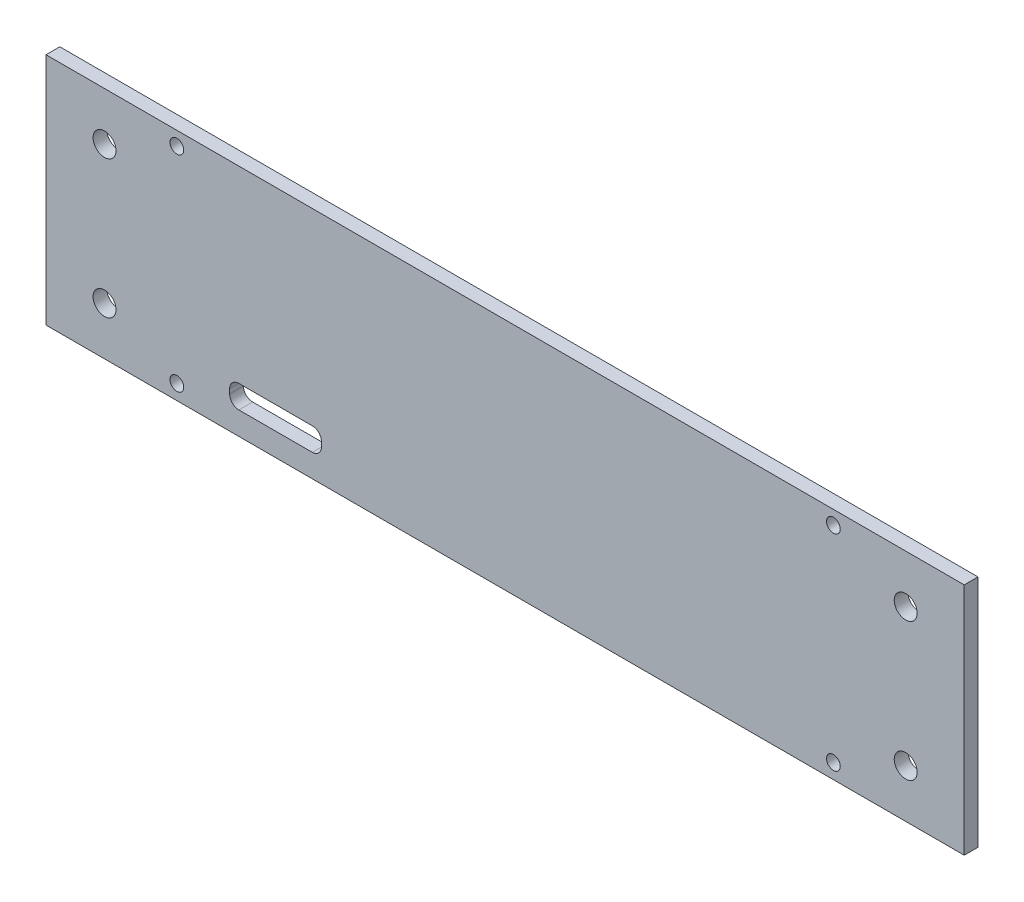
ISO-10303-21;
HEADER;
FILE_DESCRIPTION(('STEP AP214'),'2;1');
FILE_NAME('part.step','',(''),(''),'','','');
FILE_SCHEMA(('AUTOMOTIVE_DESIGN { 1 0 10303 214 1 1 1 1 }'));
ENDSEC;
DATA;
#1=APPLICATION_CONTEXT('core data for automotive mechanical design processes');
#2=APPLICATION_PROTOCOL_DEFINITION('international standard','automotive_design',2000,#1);
#3=PRODUCT_CONTEXT('',#1,'mechanical');
#4=PRODUCT('Part','Part','',(#3));
#5=PRODUCT_RELATED_PRODUCT_CATEGORY('part','',(#4));
#6=PRODUCT_DEFINITION_FORMATION('','',#4);
#7=PRODUCT_DEFINITION_CONTEXT('part definition',#1,'design');
#8=PRODUCT_DEFINITION('design','',#6,#7);
#9=PRODUCT_DEFINITION_SHAPE('','',#8);
#10=(LENGTH_UNIT() NAMED_UNIT(*) SI_UNIT(.MILLI.,.METRE.));
#11=(NAMED_UNIT(*) PLANE_ANGLE_UNIT() SI_UNIT($,.RADIAN.));
#12=(NAMED_UNIT(*) SI_UNIT($,.STERADIAN.) SOLID_ANGLE_UNIT());
#13=UNCERTAINTY_MEASURE_WITH_UNIT(LENGTH_MEASURE(1.E-05),#10,'distance_accuracy_value','');
#14=(GEOMETRIC_REPRESENTATION_CONTEXT(3) GLOBAL_UNCERTAINTY_ASSIGNED_CONTEXT((#13)) GLOBAL_UNIT_ASSIGNED_CONTEXT((#10,
#11,#12)) REPRESENTATION_CONTEXT('',''));
#15=CARTESIAN_POINT('',(0.,0.,0.));
#16=DIRECTION('',(0.,0.,1.));
#17=DIRECTION('',(1.,0.,0.));
#18=AXIS2_PLACEMENT_3D('',#15,#16,#17);
#19=CARTESIAN_POINT('',(0.,51.,3.));
#20=DIRECTION('',(0.,1.,0.));
#21=DIRECTION('',(0.,0.,1.));
#22=AXIS2_PLACEMENT_3D('',#19,#20,#21);
#23=PLANE('',#22);
#24=DIRECTION('',(1.,0.,0.));
#25=VECTOR('',#24,1.);
#26=CARTESIAN_POINT('',(0.,51.,0.));
#27=LINE('',#26,#25);
#28=CARTESIAN_POINT('',(0.,51.,0.));
#29=VERTEX_POINT('',#28);
#30=CARTESIAN_POINT('',(200.,51.,0.));
#31=VERTEX_POINT('',#30);
#32=EDGE_CURVE('E164',#29,#31,#27,.T.);
#33=ORIENTED_EDGE('',*,*,#32,.F.);
#34=DIRECTION('',(0.,0.,-1.));
#35=VECTOR('',#34,1.);
#36=CARTESIAN_POINT('',(0.,51.,3.));
#37=LINE('',#36,#35);
#38=CARTESIAN_POINT('',(0.,51.,3.));
#39=VERTEX_POINT('',#38);
#40=EDGE_CURVE('E152',#39,#29,#37,.T.);
#41=ORIENTED_EDGE('',*,*,#40,.F.);
#42=DIRECTION('',(1.,0.,0.));
#43=VECTOR('',#42,1.);
#44=CARTESIAN_POINT('',(0.,51.,3.));
#45=LINE('',#44,#43);
#46=CARTESIAN_POINT('',(200.,51.,3.));
#47=VERTEX_POINT('',#46);
#48=EDGE_CURVE('E133',#39,#47,#45,.T.);
#49=ORIENTED_EDGE('',*,*,#48,.T.);
#50=DIRECTION('',(0.,0.,-1.));
#51=VECTOR('',#50,1.);
#52=CARTESIAN_POINT('',(200.,51.,3.));
#53=LINE('',#52,#51);
#54=EDGE_CURVE('E142',#47,#31,#53,.T.);
#55=ORIENTED_EDGE('',*,*,#54,.T.);
#56=EDGE_LOOP('',(#33,#41,#49,#55));
#57=FACE_BOUND('',#56,.T.);
#58=ADVANCED_FACE('F39',(#57),#23,.T.);
#59=CARTESIAN_POINT('',(0.,0.,3.));
#60=DIRECTION('',(-1.,0.,0.));
#61=DIRECTION('',(0.,0.,1.));
#62=AXIS2_PLACEMENT_3D('',#59,#60,#61);
#63=PLANE('',#62);
#64=DIRECTION('',(0.,1.,0.));
#65=VECTOR('',#64,1.);
#66=CARTESIAN_POINT('',(0.,0.,0.));
#67=LINE('',#66,#65);
#68=CARTESIAN_POINT('',(0.,0.,0.));
#69=VERTEX_POINT('',#68);
#70=EDGE_CURVE('E153',#69,#29,#67,.T.);
#71=ORIENTED_EDGE('',*,*,#70,.F.);
#72=DIRECTION('',(0.,0.,-1.));
#73=VECTOR('',#72,1.);
#74=CARTESIAN_POINT('',(0.,0.,3.));
#75=LINE('',#74,#73);
#76=CARTESIAN_POINT('',(0.,0.,3.));
#77=VERTEX_POINT('',#76);
#78=EDGE_CURVE('E170',#77,#69,#75,.T.);
#79=ORIENTED_EDGE('',*,*,#78,.F.);
#80=DIRECTION('',(0.,1.,0.));
#81=VECTOR('',#80,1.);
#82=CARTESIAN_POINT('',(0.,0.,3.));
#83=LINE('',#82,#81);
#84=EDGE_CURVE('E150',#77,#39,#83,.T.);
#85=ORIENTED_EDGE('',*,*,#84,.T.);
#86=ORIENTED_EDGE('',*,*,#40,.T.);
#87=EDGE_LOOP('',(#71,#79,#85,#86));
#88=FACE_BOUND('',#87,.T.);
#89=ADVANCED_FACE('F295',(#88),#63,.T.);
#90=CARTESIAN_POINT('',(0.,0.,3.));
#91=DIRECTION('',(0.,1.,0.));
#92=DIRECTION('',(0.,0.,1.));
#93=AXIS2_PLACEMENT_3D('',#90,#91,#92);
#94=PLANE('',#93);
#95=DIRECTION('',(1.,0.,0.));
#96=VECTOR('',#95,1.);
#97=CARTESIAN_POINT('',(0.,0.,0.));
#98=LINE('',#97,#96);
#99=CARTESIAN_POINT('',(200.,0.,0.));
#100=VERTEX_POINT('',#99);
#101=EDGE_CURVE('E156',#69,#100,#98,.T.);
#102=ORIENTED_EDGE('',*,*,#101,.T.);
#103=DIRECTION('',(0.,0.,-1.));
#104=VECTOR('',#103,1.);
#105=CARTESIAN_POINT('',(200.,0.,3.));
#106=LINE('',#105,#104);
#107=CARTESIAN_POINT('',(200.,0.,3.));
#108=VERTEX_POINT('',#107);
#109=EDGE_CURVE('E149',#108,#100,#106,.T.);
#110=ORIENTED_EDGE('',*,*,#109,.F.);
#111=DIRECTION('',(1.,0.,0.));
#112=VECTOR('',#111,1.);
#113=CARTESIAN_POINT('',(0.,0.,3.));
#114=LINE('',#113,#112);
#115=EDGE_CURVE('E136',#77,#108,#114,.T.);
#116=ORIENTED_EDGE('',*,*,#115,.F.);
#117=ORIENTED_EDGE('',*,*,#78,.T.);
#118=EDGE_LOOP('',(#102,#110,#116,#117));
#119=FACE_BOUND('',#118,.T.);
#120=ADVANCED_FACE('F297',(#119),#94,.F.);
#121=CARTESIAN_POINT('',(200.,0.,3.));
#122=DIRECTION('',(-1.,0.,0.));
#123=DIRECTION('',(0.,0.,1.));
#124=AXIS2_PLACEMENT_3D('',#121,#122,#123);
#125=PLANE('',#124);
#126=DIRECTION('',(0.,1.,0.));
#127=VECTOR('',#126,1.);
#128=CARTESIAN_POINT('',(200.,0.,0.));
#129=LINE('',#128,#127);
#130=EDGE_CURVE('E145',#100,#31,#129,.T.);
#131=ORIENTED_EDGE('',*,*,#130,.T.);
#132=ORIENTED_EDGE('',*,*,#54,.F.);
#133=DIRECTION('',(0.,1.,0.));
#134=VECTOR('',#133,1.);
#135=CARTESIAN_POINT('',(200.,0.,3.));
#136=LINE('',#135,#134);
#137=EDGE_CURVE('E128',#108,#47,#136,.T.);
#138=ORIENTED_EDGE('',*,*,#137,.F.);
#139=ORIENTED_EDGE('',*,*,#109,.T.);
#140=EDGE_LOOP('',(#131,#132,#138,#139));
#141=FACE_BOUND('',#140,.T.);
#142=ADVANCED_FACE('F143',(#141),#125,.F.);
#143=CARTESIAN_POINT('',(0.,0.,3.));
#144=DIRECTION('',(0.,0.,1.));
#145=DIRECTION('',(1.,0.,0.));
#146=AXIS2_PLACEMENT_3D('',#143,#144,#145);
#147=PLANE('',#146);
#148=DIRECTION('',(0.,-1.,0.));
#149=VECTOR('',#148,1.);
#150=CARTESIAN_POINT('',(40.,10.,3.));
#151=LINE('',#150,#149);
#152=CARTESIAN_POINT('',(40.,8.,3.));
#153=VERTEX_POINT('',#152);
#154=CARTESIAN_POINT('',(40.,7.,3.));
#155=VERTEX_POINT('',#154);
#156=EDGE_CURVE('E205',#153,#155,#151,.T.);
#157=ORIENTED_EDGE('',*,*,#156,.F.);
#158=CARTESIAN_POINT('',(42.,8.,3.));
#159=DIRECTION('',(0.,0.,1.));
#160=DIRECTION('',(1.,0.,0.));
#161=AXIS2_PLACEMENT_3D('',#158,#159,#160);
#162=CIRCLE('',#161,2.);
#163=CARTESIAN_POINT('',(42.,10.,3.));
#164=VERTEX_POINT('',#163);
#165=EDGE_CURVE('E47',#153,#164,#162,.F.);
#166=ORIENTED_EDGE('',*,*,#165,.T.);
#167=DIRECTION('',(-1.,0.,0.));
#168=VECTOR('',#167,1.);
#169=CARTESIAN_POINT('',(40.,10.,3.));
#170=LINE('',#169,#168);
#171=CARTESIAN_POINT('',(58.,10.,3.));
#172=VERTEX_POINT('',#171);
#173=EDGE_CURVE('E204',#172,#164,#170,.T.);
#174=ORIENTED_EDGE('',*,*,#173,.F.);
#175=CARTESIAN_POINT('',(58.,8.,3.));
#176=DIRECTION('',(0.,0.,1.));
#177=DIRECTION('',(1.,0.,0.));
#178=AXIS2_PLACEMENT_3D('',#175,#176,#177);
#179=CIRCLE('',#178,2.);
#180=CARTESIAN_POINT('',(60.,8.,3.));
#181=VERTEX_POINT('',#180);
#182=EDGE_CURVE('E191',#172,#181,#179,.F.);
#183=ORIENTED_EDGE('',*,*,#182,.T.);
#184=DIRECTION('',(0.,1.,0.));
#185=VECTOR('',#184,1.);
#186=CARTESIAN_POINT('',(60.,10.,3.));
#187=LINE('',#186,#185);
#188=CARTESIAN_POINT('',(60.,7.,3.));
#189=VERTEX_POINT('',#188);
#190=EDGE_CURVE('E212',#189,#181,#187,.T.);
#191=ORIENTED_EDGE('',*,*,#190,.F.);
#192=CARTESIAN_POINT('',(58.,7.,3.));
#193=DIRECTION('',(0.,0.,1.));
#194=DIRECTION('',(1.,0.,0.));
#195=AXIS2_PLACEMENT_3D('',#192,#193,#194);
#196=CIRCLE('',#195,2.);
#197=CARTESIAN_POINT('',(58.,5.,3.));
#198=VERTEX_POINT('',#197);
#199=EDGE_CURVE('E195',#189,#198,#196,.F.);
#200=ORIENTED_EDGE('',*,*,#199,.T.);
#201=DIRECTION('',(1.,0.,0.));
#202=VECTOR('',#201,1.);
#203=CARTESIAN_POINT('',(40.,5.,3.));
#204=LINE('',#203,#202);
#205=CARTESIAN_POINT('',(42.,5.,3.));
#206=VERTEX_POINT('',#205);
#207=EDGE_CURVE('E235',#206,#198,#204,.T.);
#208=ORIENTED_EDGE('',*,*,#207,.F.);
#209=CARTESIAN_POINT('',(42.,7.,3.));
#210=DIRECTION('',(0.,0.,1.));
#211=DIRECTION('',(1.,0.,0.));
#212=AXIS2_PLACEMENT_3D('',#209,#210,#211);
#213=CIRCLE('',#212,2.);
#214=EDGE_CURVE('E54',#206,#155,#213,.F.);
#215=ORIENTED_EDGE('',*,*,#214,.T.);
#216=EDGE_LOOP('',(#157,#166,#174,#183,#191,#200,#208,#215));
#217=FACE_BOUND('',#216,.T.);
#218=CARTESIAN_POINT('',(187.25,40.5,3.));
#219=DIRECTION('',(0.,0.,1.));
#220=DIRECTION('',(-1.,0.,0.));
#221=AXIS2_PLACEMENT_3D('',#218,#219,#220);
#222=CIRCLE('',#221,2.50000000000002);
#223=CARTESIAN_POINT('',(184.75,40.5,3.));
#224=VERTEX_POINT('',#223);
#225=EDGE_CURVE('E247',#224,#224,#222,.T.);
#226=ORIENTED_EDGE('',*,*,#225,.F.);
#227=EDGE_LOOP('',(#226));
#228=FACE_BOUND('',#227,.T.);
#229=CARTESIAN_POINT('',(12.75,10.5,3.));
#230=DIRECTION('',(0.,0.,1.));
#231=DIRECTION('',(1.,0.,0.));
#232=AXIS2_PLACEMENT_3D('',#229,#230,#231);
#233=CIRCLE('',#232,2.5);
#234=CARTESIAN_POINT('',(15.25,10.5,3.));
#235=VERTEX_POINT('',#234);
#236=EDGE_CURVE('E258',#235,#235,#233,.T.);
#237=ORIENTED_EDGE('',*,*,#236,.F.);
#238=EDGE_LOOP('',(#237));
#239=FACE_BOUND('',#238,.T.);
#240=CARTESIAN_POINT('',(12.75,40.5,3.));
#241=DIRECTION('',(0.,0.,1.));
#242=DIRECTION('',(1.,0.,0.));
#243=AXIS2_PLACEMENT_3D('',#240,#241,#242);
#244=CIRCLE('',#243,2.5);
#245=CARTESIAN_POINT('',(15.25,40.5,3.));
#246=VERTEX_POINT('',#245);
#247=EDGE_CURVE('E265',#246,#246,#244,.T.);
#248=ORIENTED_EDGE('',*,*,#247,.F.);
#249=EDGE_LOOP('',(#248));
#250=FACE_BOUND('',#249,.T.);
#251=CARTESIAN_POINT('',(28.5,3.25,3.));
#252=DIRECTION('',(0.,0.,1.));
#253=DIRECTION('',(1.,0.,0.));
#254=AXIS2_PLACEMENT_3D('',#251,#252,#253);
#255=CIRCLE('',#254,1.5);
#256=CARTESIAN_POINT('',(30.,3.25,3.));
#257=VERTEX_POINT('',#256);
#258=EDGE_CURVE('E270',#257,#257,#255,.T.);
#259=ORIENTED_EDGE('',*,*,#258,.F.);
#260=EDGE_LOOP('',(#259));
#261=FACE_BOUND('',#260,.T.);
#262=CARTESIAN_POINT('',(187.25,10.5,3.));
#263=DIRECTION('',(0.,0.,1.));
#264=DIRECTION('',(-1.,0.,0.));
#265=AXIS2_PLACEMENT_3D('',#262,#263,#264);
#266=CIRCLE('',#265,2.5);
#267=CARTESIAN_POINT('',(184.75,10.5,3.));
#268=VERTEX_POINT('',#267);
#269=EDGE_CURVE('E240',#268,#268,#266,.T.);
#270=ORIENTED_EDGE('',*,*,#269,.F.);
#271=EDGE_LOOP('',(#270));
#272=FACE_BOUND('',#271,.T.);
#273=CARTESIAN_POINT('',(171.5,3.25000000000001,3.));
#274=DIRECTION('',(0.,0.,1.));
#275=DIRECTION('',(-1.,0.,0.));
#276=AXIS2_PLACEMENT_3D('',#273,#274,#275);
#277=CIRCLE('',#276,1.5);
#278=CARTESIAN_POINT('',(170.,3.25000000000001,3.));
#279=VERTEX_POINT('',#278);
#280=EDGE_CURVE('E248',#279,#279,#277,.T.);
#281=ORIENTED_EDGE('',*,*,#280,.F.);
#282=EDGE_LOOP('',(#281));
#283=FACE_BOUND('',#282,.T.);
#284=CARTESIAN_POINT('',(171.5,48.,3.));
#285=DIRECTION('',(0.,0.,1.));
#286=DIRECTION('',(-1.,0.,0.));
#287=AXIS2_PLACEMENT_3D('',#284,#285,#286);
#288=CIRCLE('',#287,1.49999999999997);
#289=CARTESIAN_POINT('',(170.,48.,3.));
#290=VERTEX_POINT('',#289);
#291=EDGE_CURVE('E229',#290,#290,#288,.T.);
#292=ORIENTED_EDGE('',*,*,#291,.F.);
#293=EDGE_LOOP('',(#292));
#294=FACE_BOUND('',#293,.T.);
#295=CARTESIAN_POINT('',(28.5,48.,3.));
#296=DIRECTION('',(0.,0.,1.));
#297=DIRECTION('',(1.,0.,0.));
#298=AXIS2_PLACEMENT_3D('',#295,#296,#297);
#299=CIRCLE('',#298,1.5);
#300=CARTESIAN_POINT('',(30.,48.,3.));
#301=VERTEX_POINT('',#300);
#302=EDGE_CURVE('E277',#301,#301,#299,.T.);
#303=ORIENTED_EDGE('',*,*,#302,.F.);
#304=EDGE_LOOP('',(#303));
#305=FACE_BOUND('',#304,.T.);
#306=ORIENTED_EDGE('',*,*,#48,.F.);
#307=ORIENTED_EDGE('',*,*,#84,.F.);
#308=ORIENTED_EDGE('',*,*,#115,.T.);
#309=ORIENTED_EDGE('',*,*,#137,.T.);
#310=EDGE_LOOP('',(#306,#307,#308,#309));
#311=FACE_BOUND('',#310,.T.);
#312=ADVANCED_FACE('F130',(#217,#228,#239,#250,#261,#272,#283,#294,#305,#311),#147,.T.);
#313=CARTESIAN_POINT('',(0.,0.,0.));
#314=DIRECTION('',(0.,0.,1.));
#315=DIRECTION('',(1.,0.,0.));
#316=AXIS2_PLACEMENT_3D('',#313,#314,#315);
#317=PLANE('',#316);
#318=DIRECTION('',(1.,0.,0.));
#319=VECTOR('',#318,1.);
#320=CARTESIAN_POINT('',(40.,10.,0.));
#321=LINE('',#320,#319);
#322=CARTESIAN_POINT('',(42.,10.,0.));
#323=VERTEX_POINT('',#322);
#324=CARTESIAN_POINT('',(58.,10.,0.));
#325=VERTEX_POINT('',#324);
#326=EDGE_CURVE('E222',#323,#325,#321,.T.);
#327=ORIENTED_EDGE('',*,*,#326,.F.);
#328=CARTESIAN_POINT('',(42.,8.,0.));
#329=DIRECTION('',(0.,0.,1.));
#330=DIRECTION('',(1.,0.,0.));
#331=AXIS2_PLACEMENT_3D('',#328,#329,#330);
#332=CIRCLE('',#331,2.);
#333=CARTESIAN_POINT('',(40.,8.,0.));
#334=VERTEX_POINT('',#333);
#335=EDGE_CURVE('E11',#323,#334,#332,.T.);
#336=ORIENTED_EDGE('',*,*,#335,.T.);
#337=DIRECTION('',(0.,1.,0.));
#338=VECTOR('',#337,1.);
#339=CARTESIAN_POINT('',(40.,10.,0.));
#340=LINE('',#339,#338);
#341=CARTESIAN_POINT('',(40.,7.,0.));
#342=VERTEX_POINT('',#341);
#343=EDGE_CURVE('E220',#342,#334,#340,.T.);
#344=ORIENTED_EDGE('',*,*,#343,.F.);
#345=CARTESIAN_POINT('',(42.,7.,0.));
#346=DIRECTION('',(0.,0.,1.));
#347=DIRECTION('',(1.,0.,0.));
#348=AXIS2_PLACEMENT_3D('',#345,#346,#347);
#349=CIRCLE('',#348,2.);
#350=CARTESIAN_POINT('',(42.,5.,0.));
#351=VERTEX_POINT('',#350);
#352=EDGE_CURVE('E200',#342,#351,#349,.T.);
#353=ORIENTED_EDGE('',*,*,#352,.T.);
#354=DIRECTION('',(-1.,0.,0.));
#355=VECTOR('',#354,1.);
#356=CARTESIAN_POINT('',(40.,5.,0.));
#357=LINE('',#356,#355);
#358=CARTESIAN_POINT('',(58.,5.,0.));
#359=VERTEX_POINT('',#358);
#360=EDGE_CURVE('E226',#359,#351,#357,.T.);
#361=ORIENTED_EDGE('',*,*,#360,.F.);
#362=CARTESIAN_POINT('',(58.,7.,0.));
#363=DIRECTION('',(0.,0.,1.));
#364=DIRECTION('',(1.,0.,0.));
#365=AXIS2_PLACEMENT_3D('',#362,#363,#364);
#366=CIRCLE('',#365,2.);
#367=CARTESIAN_POINT('',(60.,7.,0.));
#368=VERTEX_POINT('',#367);
#369=EDGE_CURVE('E197',#359,#368,#366,.T.);
#370=ORIENTED_EDGE('',*,*,#369,.T.);
#371=DIRECTION('',(0.,-1.,0.));
#372=VECTOR('',#371,1.);
#373=CARTESIAN_POINT('',(60.,10.,0.));
#374=LINE('',#373,#372);
#375=CARTESIAN_POINT('',(60.,8.,0.));
#376=VERTEX_POINT('',#375);
#377=EDGE_CURVE('E211',#376,#368,#374,.T.);
#378=ORIENTED_EDGE('',*,*,#377,.F.);
#379=CARTESIAN_POINT('',(58.,8.,0.));
#380=DIRECTION('',(0.,0.,1.));
#381=DIRECTION('',(1.,0.,0.));
#382=AXIS2_PLACEMENT_3D('',#379,#380,#381);
#383=CIRCLE('',#382,2.);
#384=EDGE_CURVE('E193',#376,#325,#383,.T.);
#385=ORIENTED_EDGE('',*,*,#384,.T.);
#386=EDGE_LOOP('',(#327,#336,#344,#353,#361,#370,#378,#385));
#387=FACE_BOUND('',#386,.T.);
#388=CARTESIAN_POINT('',(187.25,40.5,0.));
#389=DIRECTION('',(0.,0.,1.));
#390=DIRECTION('',(1.,0.,0.));
#391=AXIS2_PLACEMENT_3D('',#388,#389,#390);
#392=CIRCLE('',#391,2.50000000000002);
#393=CARTESIAN_POINT('',(189.75,40.5,0.));
#394=VERTEX_POINT('',#393);
#395=EDGE_CURVE('E262',#394,#394,#392,.F.);
#396=ORIENTED_EDGE('',*,*,#395,.F.);
#397=EDGE_LOOP('',(#396));
#398=FACE_BOUND('',#397,.T.);
#399=CARTESIAN_POINT('',(12.75,10.5,0.));
#400=DIRECTION('',(0.,0.,1.));
#401=DIRECTION('',(1.,0.,0.));
#402=AXIS2_PLACEMENT_3D('',#399,#400,#401);
#403=CIRCLE('',#402,2.5);
#404=CARTESIAN_POINT('',(15.25,10.5,0.));
#405=VERTEX_POINT('',#404);
#406=EDGE_CURVE('E261',#405,#405,#403,.F.);
#407=ORIENTED_EDGE('',*,*,#406,.F.);
#408=EDGE_LOOP('',(#407));
#409=FACE_BOUND('',#408,.T.);
#410=CARTESIAN_POINT('',(12.75,40.5,0.));
#411=DIRECTION('',(0.,0.,1.));
#412=DIRECTION('',(1.,0.,0.));
#413=AXIS2_PLACEMENT_3D('',#410,#411,#412);
#414=CIRCLE('',#413,2.5);
#415=CARTESIAN_POINT('',(15.25,40.5,0.));
#416=VERTEX_POINT('',#415);
#417=EDGE_CURVE('E274',#416,#416,#414,.F.);
#418=ORIENTED_EDGE('',*,*,#417,.F.);
#419=EDGE_LOOP('',(#418));
#420=FACE_BOUND('',#419,.T.);
#421=CARTESIAN_POINT('',(28.5,3.25,0.));
#422=DIRECTION('',(0.,0.,1.));
#423=DIRECTION('',(1.,0.,0.));
#424=AXIS2_PLACEMENT_3D('',#421,#422,#423);
#425=CIRCLE('',#424,1.5);
#426=CARTESIAN_POINT('',(30.,3.25,0.));
#427=VERTEX_POINT('',#426);
#428=EDGE_CURVE('E273',#427,#427,#425,.F.);
#429=ORIENTED_EDGE('',*,*,#428,.F.);
#430=EDGE_LOOP('',(#429));
#431=FACE_BOUND('',#430,.T.);
#432=CARTESIAN_POINT('',(187.25,10.5,0.));
#433=DIRECTION('',(0.,0.,1.));
#434=DIRECTION('',(1.,0.,0.));
#435=AXIS2_PLACEMENT_3D('',#432,#433,#434);
#436=CIRCLE('',#435,2.5);
#437=CARTESIAN_POINT('',(189.75,10.5,0.));
#438=VERTEX_POINT('',#437);
#439=EDGE_CURVE('E243',#438,#438,#436,.F.);
#440=ORIENTED_EDGE('',*,*,#439,.F.);
#441=EDGE_LOOP('',(#440));
#442=FACE_BOUND('',#441,.T.);
#443=CARTESIAN_POINT('',(171.5,3.25000000000001,0.));
#444=DIRECTION('',(0.,0.,1.));
#445=DIRECTION('',(1.,0.,0.));
#446=AXIS2_PLACEMENT_3D('',#443,#444,#445);
#447=CIRCLE('',#446,1.5);
#448=CARTESIAN_POINT('',(173.,3.25000000000001,0.));
#449=VERTEX_POINT('',#448);
#450=EDGE_CURVE('E244',#449,#449,#447,.F.);
#451=ORIENTED_EDGE('',*,*,#450,.F.);
#452=EDGE_LOOP('',(#451));
#453=FACE_BOUND('',#452,.T.);
#454=CARTESIAN_POINT('',(171.5,48.,0.));
#455=DIRECTION('',(0.,0.,1.));
#456=DIRECTION('',(1.,0.,0.));
#457=AXIS2_PLACEMENT_3D('',#454,#455,#456);
#458=CIRCLE('',#457,1.49999999999997);
#459=CARTESIAN_POINT('',(173.,48.,0.));
#460=VERTEX_POINT('',#459);
#461=EDGE_CURVE('E251',#460,#460,#458,.F.);
#462=ORIENTED_EDGE('',*,*,#461,.F.);
#463=EDGE_LOOP('',(#462));
#464=FACE_BOUND('',#463,.T.);
#465=CARTESIAN_POINT('',(28.5,48.,0.));
#466=DIRECTION('',(0.,0.,1.));
#467=DIRECTION('',(1.,0.,0.));
#468=AXIS2_PLACEMENT_3D('',#465,#466,#467);
#469=CIRCLE('',#468,1.5);
#470=CARTESIAN_POINT('',(30.,48.,0.));
#471=VERTEX_POINT('',#470);
#472=EDGE_CURVE('E159',#471,#471,#469,.F.);
#473=ORIENTED_EDGE('',*,*,#472,.F.);
#474=EDGE_LOOP('',(#473));
#475=FACE_BOUND('',#474,.T.);
#476=ORIENTED_EDGE('',*,*,#32,.T.);
#477=ORIENTED_EDGE('',*,*,#130,.F.);
#478=ORIENTED_EDGE('',*,*,#101,.F.);
#479=ORIENTED_EDGE('',*,*,#70,.T.);
#480=EDGE_LOOP('',(#476,#477,#478,#479));
#481=FACE_BOUND('',#480,.T.);
#482=ADVANCED_FACE('F218',(#387,#398,#409,#420,#431,#442,#453,#464,#475,#481),#317,.F.);
#483=CARTESIAN_POINT('',(28.5,48.,-7.07106781186555));
#484=DIRECTION('',(0.,0.,1.));
#485=DIRECTION('',(1.,0.,0.));
#486=AXIS2_PLACEMENT_3D('',#483,#484,#485);
#487=CYLINDRICAL_SURFACE('',#486,1.5);
#488=ORIENTED_EDGE('',*,*,#472,.T.);
#489=EDGE_LOOP('',(#488));
#490=FACE_BOUND('',#489,.T.);
#491=ORIENTED_EDGE('',*,*,#302,.T.);
#492=EDGE_LOOP('',(#491));
#493=FACE_BOUND('',#492,.T.);
#494=ADVANCED_FACE('F287',(#490,#493),#487,.F.);
#495=CARTESIAN_POINT('',(171.5,48.,-7.07106781186555));
#496=DIRECTION('',(0.,0.,1.));
#497=DIRECTION('',(1.,0.,0.));
#498=AXIS2_PLACEMENT_3D('',#495,#496,#497);
#499=CYLINDRICAL_SURFACE('',#498,1.49999999999997);
#500=ORIENTED_EDGE('',*,*,#461,.T.);
#501=EDGE_LOOP('',(#500));
#502=FACE_BOUND('',#501,.T.);
#503=ORIENTED_EDGE('',*,*,#291,.T.);
#504=EDGE_LOOP('',(#503));
#505=FACE_BOUND('',#504,.T.);
#506=ADVANCED_FACE('F358',(#502,#505),#499,.F.);
#507=CARTESIAN_POINT('',(171.5,3.25000000000001,-7.07106781186555));
#508=DIRECTION('',(0.,0.,1.));
#509=DIRECTION('',(1.,0.,0.));
#510=AXIS2_PLACEMENT_3D('',#507,#508,#509);
#511=CYLINDRICAL_SURFACE('',#510,1.5);
#512=ORIENTED_EDGE('',*,*,#450,.T.);
#513=EDGE_LOOP('',(#512));
#514=FACE_BOUND('',#513,.T.);
#515=ORIENTED_EDGE('',*,*,#280,.T.);
#516=EDGE_LOOP('',(#515));
#517=FACE_BOUND('',#516,.T.);
#518=ADVANCED_FACE('F354',(#514,#517),#511,.F.);
#519=CARTESIAN_POINT('',(187.25,10.5,-7.07106781186555));
#520=DIRECTION('',(0.,0.,1.));
#521=DIRECTION('',(1.,0.,0.));
#522=AXIS2_PLACEMENT_3D('',#519,#520,#521);
#523=CYLINDRICAL_SURFACE('',#522,2.5);
#524=ORIENTED_EDGE('',*,*,#439,.T.);
#525=EDGE_LOOP('',(#524));
#526=FACE_BOUND('',#525,.T.);
#527=ORIENTED_EDGE('',*,*,#269,.T.);
#528=EDGE_LOOP('',(#527));
#529=FACE_BOUND('',#528,.T.);
#530=ADVANCED_FACE('F350',(#526,#529),#523,.F.);
#531=CARTESIAN_POINT('',(28.5,3.25,-7.07106781186555));
#532=DIRECTION('',(0.,0.,1.));
#533=DIRECTION('',(1.,0.,0.));
#534=AXIS2_PLACEMENT_3D('',#531,#532,#533);
#535=CYLINDRICAL_SURFACE('',#534,1.5);
#536=ORIENTED_EDGE('',*,*,#428,.T.);
#537=EDGE_LOOP('',(#536));
#538=FACE_BOUND('',#537,.T.);
#539=ORIENTED_EDGE('',*,*,#258,.T.);
#540=EDGE_LOOP('',(#539));
#541=FACE_BOUND('',#540,.T.);
#542=ADVANCED_FACE('F353',(#538,#541),#535,.F.);
#543=CARTESIAN_POINT('',(12.75,40.5,-7.07106781186555));
#544=DIRECTION('',(0.,0.,1.));
#545=DIRECTION('',(1.,0.,0.));
#546=AXIS2_PLACEMENT_3D('',#543,#544,#545);
#547=CYLINDRICAL_SURFACE('',#546,2.5);
#548=ORIENTED_EDGE('',*,*,#417,.T.);
#549=EDGE_LOOP('',(#548));
#550=FACE_BOUND('',#549,.T.);
#551=ORIENTED_EDGE('',*,*,#247,.T.);
#552=EDGE_LOOP('',(#551));
#553=FACE_BOUND('',#552,.T.);
#554=ADVANCED_FACE('F366',(#550,#553),#547,.F.);
#555=CARTESIAN_POINT('',(12.75,10.5,-7.07106781186555));
#556=DIRECTION('',(0.,0.,1.));
#557=DIRECTION('',(1.,0.,0.));
#558=AXIS2_PLACEMENT_3D('',#555,#556,#557);
#559=CYLINDRICAL_SURFACE('',#558,2.5);
#560=ORIENTED_EDGE('',*,*,#406,.T.);
#561=EDGE_LOOP('',(#560));
#562=FACE_BOUND('',#561,.T.);
#563=ORIENTED_EDGE('',*,*,#236,.T.);
#564=EDGE_LOOP('',(#563));
#565=FACE_BOUND('',#564,.T.);
#566=ADVANCED_FACE('F363',(#562,#565),#559,.F.);
#567=CARTESIAN_POINT('',(187.25,40.5,-7.07106781186555));
#568=DIRECTION('',(0.,0.,1.));
#569=DIRECTION('',(1.,0.,0.));
#570=AXIS2_PLACEMENT_3D('',#567,#568,#569);
#571=CYLINDRICAL_SURFACE('',#570,2.50000000000002);
#572=ORIENTED_EDGE('',*,*,#395,.T.);
#573=EDGE_LOOP('',(#572));
#574=FACE_BOUND('',#573,.T.);
#575=ORIENTED_EDGE('',*,*,#225,.T.);
#576=EDGE_LOOP('',(#575));
#577=FACE_BOUND('',#576,.T.);
#578=ADVANCED_FACE('F349',(#574,#577),#571,.F.);
#579=CARTESIAN_POINT('',(40.,10.,-20.6155281280883));
#580=DIRECTION('',(-1.,0.,0.));
#581=DIRECTION('',(0.,0.,1.));
#582=AXIS2_PLACEMENT_3D('',#579,#580,#581);
#583=PLANE('',#582);
#584=ORIENTED_EDGE('',*,*,#156,.T.);
#585=DIRECTION('',(0.,0.,1.));
#586=VECTOR('',#585,1.);
#587=CARTESIAN_POINT('',(40.,7.,0.));
#588=LINE('',#587,#586);
#589=EDGE_CURVE('E189',#155,#342,#588,.F.);
#590=ORIENTED_EDGE('',*,*,#589,.T.);
#591=ORIENTED_EDGE('',*,*,#343,.T.);
#592=DIRECTION('',(0.,0.,1.));
#593=VECTOR('',#592,1.);
#594=CARTESIAN_POINT('',(40.,8.,3.));
#595=LINE('',#594,#593);
#596=EDGE_CURVE('E187',#334,#153,#595,.T.);
#597=ORIENTED_EDGE('',*,*,#596,.T.);
#598=EDGE_LOOP('',(#584,#590,#591,#597));
#599=FACE_BOUND('',#598,.T.);
#600=ADVANCED_FACE('F224',(#599),#583,.F.);
#601=CARTESIAN_POINT('',(40.,10.,-20.6155281280883));
#602=DIRECTION('',(0.,1.,0.));
#603=DIRECTION('',(0.,0.,1.));
#604=AXIS2_PLACEMENT_3D('',#601,#602,#603);
#605=PLANE('',#604);
#606=ORIENTED_EDGE('',*,*,#326,.T.);
#607=DIRECTION('',(0.,0.,1.));
#608=VECTOR('',#607,1.);
#609=CARTESIAN_POINT('',(58.,10.,3.));
#610=LINE('',#609,#608);
#611=EDGE_CURVE('E174',#325,#172,#610,.T.);
#612=ORIENTED_EDGE('',*,*,#611,.T.);
#613=ORIENTED_EDGE('',*,*,#173,.T.);
#614=DIRECTION('',(0.,0.,1.));
#615=VECTOR('',#614,1.);
#616=CARTESIAN_POINT('',(42.,10.,0.));
#617=LINE('',#616,#615);
#618=EDGE_CURVE('E169',#164,#323,#617,.F.);
#619=ORIENTED_EDGE('',*,*,#618,.T.);
#620=EDGE_LOOP('',(#606,#612,#613,#619));
#621=FACE_BOUND('',#620,.T.);
#622=ADVANCED_FACE('F208',(#621),#605,.F.);
#623=CARTESIAN_POINT('',(60.,10.,-20.6155281280883));
#624=DIRECTION('',(1.,0.,0.));
#625=DIRECTION('',(0.,0.,-1.));
#626=AXIS2_PLACEMENT_3D('',#623,#624,#625);
#627=PLANE('',#626);
#628=ORIENTED_EDGE('',*,*,#190,.T.);
#629=DIRECTION('',(0.,0.,1.));
#630=VECTOR('',#629,1.);
#631=CARTESIAN_POINT('',(60.,8.,0.));
#632=LINE('',#631,#630);
#633=EDGE_CURVE('E180',#181,#376,#632,.F.);
#634=ORIENTED_EDGE('',*,*,#633,.T.);
#635=ORIENTED_EDGE('',*,*,#377,.T.);
#636=DIRECTION('',(0.,0.,1.));
#637=VECTOR('',#636,1.);
#638=CARTESIAN_POINT('',(60.,7.,3.));
#639=LINE('',#638,#637);
#640=EDGE_CURVE('E177',#368,#189,#639,.T.);
#641=ORIENTED_EDGE('',*,*,#640,.T.);
#642=EDGE_LOOP('',(#628,#634,#635,#641));
#643=FACE_BOUND('',#642,.T.);
#644=ADVANCED_FACE('F335',(#643),#627,.F.);
#645=CARTESIAN_POINT('',(40.,5.,-20.6155281280883));
#646=DIRECTION('',(0.,-1.,0.));
#647=DIRECTION('',(0.,0.,-1.));
#648=AXIS2_PLACEMENT_3D('',#645,#646,#647);
#649=PLANE('',#648);
#650=ORIENTED_EDGE('',*,*,#207,.T.);
#651=DIRECTION('',(0.,0.,1.));
#652=VECTOR('',#651,1.);
#653=CARTESIAN_POINT('',(58.,5.,0.));
#654=LINE('',#653,#652);
#655=EDGE_CURVE('E185',#198,#359,#654,.F.);
#656=ORIENTED_EDGE('',*,*,#655,.T.);
#657=ORIENTED_EDGE('',*,*,#360,.T.);
#658=DIRECTION('',(0.,0.,1.));
#659=VECTOR('',#658,1.);
#660=CARTESIAN_POINT('',(42.,5.,3.));
#661=LINE('',#660,#659);
#662=EDGE_CURVE('E182',#351,#206,#661,.T.);
#663=ORIENTED_EDGE('',*,*,#662,.T.);
#664=EDGE_LOOP('',(#650,#656,#657,#663));
#665=FACE_BOUND('',#664,.T.);
#666=ADVANCED_FACE('F315',(#665),#649,.F.);
#667=CARTESIAN_POINT('',(58.,8.,-20.6155281280883));
#668=DIRECTION('',(0.,0.,-1.));
#669=DIRECTION('',(-1.,0.,0.));
#670=AXIS2_PLACEMENT_3D('',#667,#668,#669);
#671=CYLINDRICAL_SURFACE('',#670,2.);
#672=ORIENTED_EDGE('',*,*,#384,.F.);
#673=ORIENTED_EDGE('',*,*,#633,.F.);
#674=ORIENTED_EDGE('',*,*,#182,.F.);
#675=ORIENTED_EDGE('',*,*,#611,.F.);
#676=EDGE_LOOP('',(#672,#673,#674,#675));
#677=FACE_BOUND('',#676,.T.);
#678=ADVANCED_FACE('F311',(#677),#671,.F.);
#679=CARTESIAN_POINT('',(58.,7.,-20.6155281280883));
#680=DIRECTION('',(0.,0.,-1.));
#681=DIRECTION('',(-1.,0.,0.));
#682=AXIS2_PLACEMENT_3D('',#679,#680,#681);
#683=CYLINDRICAL_SURFACE('',#682,2.);
#684=ORIENTED_EDGE('',*,*,#369,.F.);
#685=ORIENTED_EDGE('',*,*,#655,.F.);
#686=ORIENTED_EDGE('',*,*,#199,.F.);
#687=ORIENTED_EDGE('',*,*,#640,.F.);
#688=EDGE_LOOP('',(#684,#685,#686,#687));
#689=FACE_BOUND('',#688,.T.);
#690=ADVANCED_FACE('F314',(#689),#683,.F.);
#691=CARTESIAN_POINT('',(42.,7.,-20.6155281280883));
#692=DIRECTION('',(0.,0.,-1.));
#693=DIRECTION('',(-1.,0.,0.));
#694=AXIS2_PLACEMENT_3D('',#691,#692,#693);
#695=CYLINDRICAL_SURFACE('',#694,2.);
#696=ORIENTED_EDGE('',*,*,#352,.F.);
#697=ORIENTED_EDGE('',*,*,#589,.F.);
#698=ORIENTED_EDGE('',*,*,#214,.F.);
#699=ORIENTED_EDGE('',*,*,#662,.F.);
#700=EDGE_LOOP('',(#696,#697,#698,#699));
#701=FACE_BOUND('',#700,.T.);
#702=ADVANCED_FACE('F318',(#701),#695,.F.);
#703=CARTESIAN_POINT('',(42.,8.,-20.6155281280883));
#704=DIRECTION('',(0.,0.,-1.));
#705=DIRECTION('',(-1.,0.,0.));
#706=AXIS2_PLACEMENT_3D('',#703,#704,#705);
#707=CYLINDRICAL_SURFACE('',#706,2.);
#708=ORIENTED_EDGE('',*,*,#335,.F.);
#709=ORIENTED_EDGE('',*,*,#618,.F.);
#710=ORIENTED_EDGE('',*,*,#165,.F.);
#711=ORIENTED_EDGE('',*,*,#596,.F.);
#712=EDGE_LOOP('',(#708,#709,#710,#711));
#713=FACE_BOUND('',#712,.T.);
#714=ADVANCED_FACE('F41',(#713),#707,.F.);
#715=CLOSED_SHELL('',(#58,#89,#120,#142,#312,#482,#494,#506,#518,#530,#542,#554,#566,#578,#600,
#622,#644,#666,#678,#690,#702,#714));
#716=MANIFOLD_SOLID_BREP('B2',#715);
#717=ADVANCED_BREP_SHAPE_REPRESENTATION('',(#18,#716),#14);
#718=SHAPE_DEFINITION_REPRESENTATION(#9,#717);
ENDSEC;
END-ISO-10303-21;
